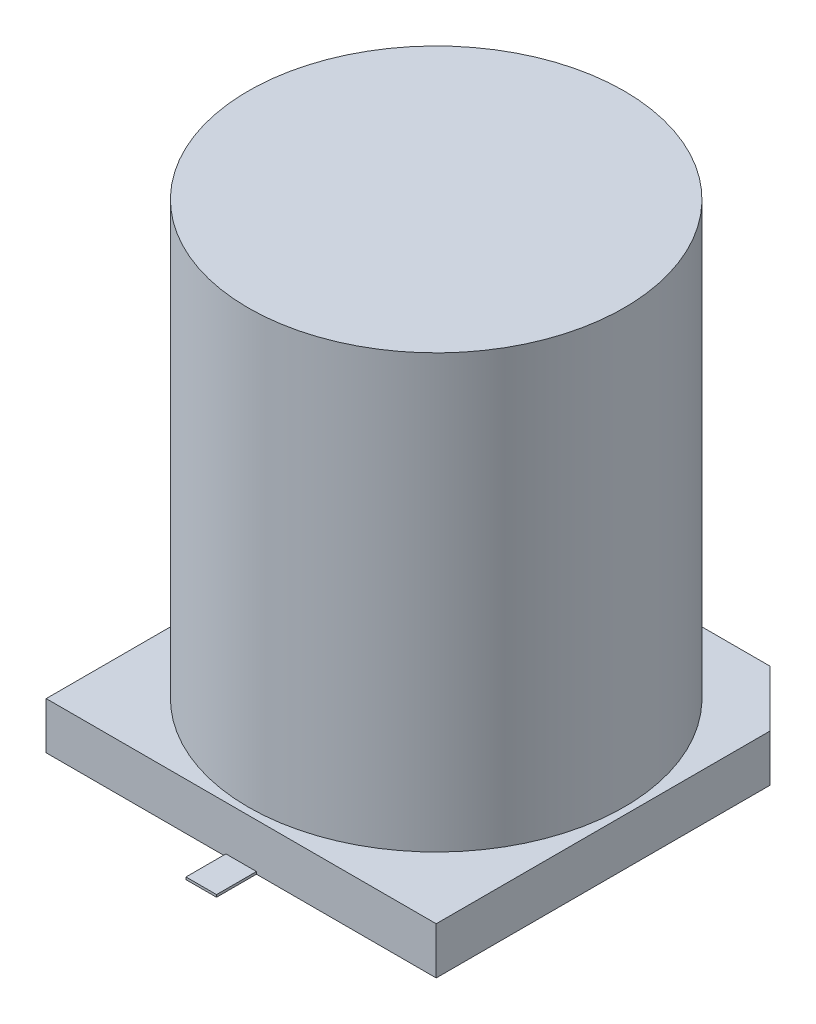
ISO-10303-21;
HEADER;
FILE_DESCRIPTION(('STEP AP214'),'2;1');
FILE_NAME('part.step','',(''),(''),'','','');
FILE_SCHEMA(('AUTOMOTIVE_DESIGN { 1 0 10303 214 1 1 1 1 }'));
ENDSEC;
DATA;
#1=APPLICATION_CONTEXT('core data for automotive mechanical design processes');
#2=APPLICATION_PROTOCOL_DEFINITION('international standard','automotive_design',2000,#1);
#3=PRODUCT_CONTEXT('',#1,'mechanical');
#4=PRODUCT('Part','Part','',(#3));
#5=PRODUCT_RELATED_PRODUCT_CATEGORY('part','',(#4));
#6=PRODUCT_DEFINITION_FORMATION('','',#4);
#7=PRODUCT_DEFINITION_CONTEXT('part definition',#1,'design');
#8=PRODUCT_DEFINITION('design','',#6,#7);
#9=PRODUCT_DEFINITION_SHAPE('','',#8);
#10=(LENGTH_UNIT() NAMED_UNIT(*) SI_UNIT(.MILLI.,.METRE.));
#11=(NAMED_UNIT(*) PLANE_ANGLE_UNIT() SI_UNIT($,.RADIAN.));
#12=(NAMED_UNIT(*) SI_UNIT($,.STERADIAN.) SOLID_ANGLE_UNIT());
#13=UNCERTAINTY_MEASURE_WITH_UNIT(LENGTH_MEASURE(1.E-05),#10,'distance_accuracy_value','');
#14=(GEOMETRIC_REPRESENTATION_CONTEXT(3) GLOBAL_UNCERTAINTY_ASSIGNED_CONTEXT((#13)) GLOBAL_UNIT_ASSIGNED_CONTEXT((#10,
#11,#12)) REPRESENTATION_CONTEXT('',''));
#15=CARTESIAN_POINT('',(0.,0.,0.));
#16=DIRECTION('',(0.,0.,1.));
#17=DIRECTION('',(1.,0.,0.));
#18=AXIS2_PLACEMENT_3D('',#15,#16,#17);
#19=CARTESIAN_POINT('',(0.325000000000075,0.0500000000000014,5.));
#20=DIRECTION('',(0.,0.,-1.));
#21=DIRECTION('',(-1.,0.,0.));
#22=AXIS2_PLACEMENT_3D('',#19,#20,#21);
#23=PLANE('',#22);
#24=DIRECTION('',(0.,1.,0.));
#25=VECTOR('',#24,1.);
#26=CARTESIAN_POINT('',(0.325000000000007,0.0500000000000014,5.));
#27=LINE('',#26,#25);
#28=CARTESIAN_POINT('',(0.325000000000058,0.,5.));
#29=VERTEX_POINT('',#28);
#30=CARTESIAN_POINT('',(0.325000000000041,0.0500000000000014,5.));
#31=VERTEX_POINT('',#30);
#32=EDGE_CURVE('E114',#29,#31,#27,.T.);
#33=ORIENTED_EDGE('',*,*,#32,.T.);
#34=DIRECTION('',(1.,0.,0.));
#35=VECTOR('',#34,1.);
#36=CARTESIAN_POINT('',(0.325000000000075,0.0500000000000014,5.));
#37=LINE('',#36,#35);
#38=CARTESIAN_POINT('',(-0.324999999999923,0.0500000000000014,5.));
#39=VERTEX_POINT('',#38);
#40=EDGE_CURVE('E116',#31,#39,#37,.F.);
#41=ORIENTED_EDGE('',*,*,#40,.T.);
#42=DIRECTION('',(0.,1.,0.));
#43=VECTOR('',#42,1.);
#44=CARTESIAN_POINT('',(-0.324999999999923,0.0500000000000014,4.99999999999999));
#45=LINE('',#44,#43);
#46=CARTESIAN_POINT('',(-0.32499999999994,0.,4.99999999999999));
#47=VERTEX_POINT('',#46);
#48=EDGE_CURVE('E119',#39,#47,#45,.F.);
#49=ORIENTED_EDGE('',*,*,#48,.T.);
#50=DIRECTION('',(1.,0.,0.));
#51=VECTOR('',#50,1.);
#52=CARTESIAN_POINT('',(4.15000000000008,0.,4.99999999999999));
#53=LINE('',#52,#51);
#54=EDGE_CURVE('E154',#47,#29,#53,.T.);
#55=ORIENTED_EDGE('',*,*,#54,.T.);
#56=EDGE_LOOP('',(#33,#41,#49,#55));
#57=FACE_BOUND('',#56,.T.);
#58=ADVANCED_FACE('F17',(#57),#23,.F.);
#59=CARTESIAN_POINT('',(0.325000000000006,0.0500000000000014,-4.99999999999999));
#60=DIRECTION('',(0.,0.,1.));
#61=DIRECTION('',(1.,0.,0.));
#62=AXIS2_PLACEMENT_3D('',#59,#60,#61);
#63=PLANE('',#62);
#64=DIRECTION('',(0.,1.,0.));
#65=VECTOR('',#64,1.);
#66=CARTESIAN_POINT('',(-0.324999999999992,0.0500000000000014,-5.));
#67=LINE('',#66,#65);
#68=CARTESIAN_POINT('',(-0.324999999999992,0.,-4.99999999999999));
#69=VERTEX_POINT('',#68);
#70=CARTESIAN_POINT('',(-0.324999999999992,0.0500000000000014,-4.99999999999999));
#71=VERTEX_POINT('',#70);
#72=EDGE_CURVE('E149',#69,#71,#67,.T.);
#73=ORIENTED_EDGE('',*,*,#72,.T.);
#74=DIRECTION('',(1.,0.,0.));
#75=VECTOR('',#74,1.);
#76=CARTESIAN_POINT('',(-0.324999999999992,0.0500000000000014,-4.99999999999999));
#77=LINE('',#76,#75);
#78=CARTESIAN_POINT('',(0.325000000000019,0.0500000000000014,-4.99999999999999));
#79=VERTEX_POINT('',#78);
#80=EDGE_CURVE('E141',#79,#71,#77,.F.);
#81=ORIENTED_EDGE('',*,*,#80,.F.);
#82=DIRECTION('',(0.,1.,0.));
#83=VECTOR('',#82,1.);
#84=CARTESIAN_POINT('',(0.324999999999991,0.0500000000000014,-4.99999999999999));
#85=LINE('',#84,#83);
#86=CARTESIAN_POINT('',(0.325000000000016,0.,-4.99999999999999));
#87=VERTEX_POINT('',#86);
#88=EDGE_CURVE('E144',#79,#87,#85,.F.);
#89=ORIENTED_EDGE('',*,*,#88,.T.);
#90=DIRECTION('',(1.,0.,0.));
#91=VECTOR('',#90,1.);
#92=CARTESIAN_POINT('',(4.15000000000008,0.,-4.99999999999999));
#93=LINE('',#92,#91);
#94=EDGE_CURVE('E161',#87,#69,#93,.F.);
#95=ORIENTED_EDGE('',*,*,#94,.T.);
#96=EDGE_LOOP('',(#73,#81,#89,#95));
#97=FACE_BOUND('',#96,.T.);
#98=ADVANCED_FACE('F294',(#97),#63,.F.);
#99=CARTESIAN_POINT('',(0.325000000000075,0.0500000000000014,5.));
#100=DIRECTION('',(0.,-1.,0.));
#101=DIRECTION('',(0.,0.,-1.));
#102=AXIS2_PLACEMENT_3D('',#99,#100,#101);
#103=PLANE('',#102);
#104=DIRECTION('',(-1.,0.,0.));
#105=VECTOR('',#104,1.);
#106=CARTESIAN_POINT('',(4.15,0.0500000000000014,4.15000000000008));
#107=LINE('',#106,#105);
#108=CARTESIAN_POINT('',(0.325000000000006,0.0500000000000014,4.15000000000002));
#109=VERTEX_POINT('',#108);
#110=CARTESIAN_POINT('',(-0.32499999999994,0.0500000000000014,4.15000000000002));
#111=VERTEX_POINT('',#110);
#112=EDGE_CURVE('E128',#109,#111,#107,.T.);
#113=ORIENTED_EDGE('',*,*,#112,.T.);
#114=DIRECTION('',(0.,0.,-1.));
#115=VECTOR('',#114,1.);
#116=CARTESIAN_POINT('',(-0.324999999999923,0.0500000000000014,4.99999999999999));
#117=LINE('',#116,#115);
#118=EDGE_CURVE('E125',#111,#39,#117,.F.);
#119=ORIENTED_EDGE('',*,*,#118,.T.);
#120=ORIENTED_EDGE('',*,*,#40,.F.);
#121=DIRECTION('',(0.,0.,1.));
#122=VECTOR('',#121,1.);
#123=CARTESIAN_POINT('',(0.325000000000006,0.0500000000000014,2.05000000000001));
#124=LINE('',#123,#122);
#125=EDGE_CURVE('E139',#31,#109,#124,.F.);
#126=ORIENTED_EDGE('',*,*,#125,.T.);
#127=EDGE_LOOP('',(#113,#119,#120,#126));
#128=FACE_BOUND('',#127,.T.);
#129=ADVANCED_FACE('F126',(#128),#103,.F.);
#130=CARTESIAN_POINT('',(-0.324999999999923,0.0500000000000014,4.99999999999999));
#131=DIRECTION('',(1.,0.,0.));
#132=DIRECTION('',(0.,0.,-1.));
#133=AXIS2_PLACEMENT_3D('',#130,#131,#132);
#134=PLANE('',#133);
#135=DIRECTION('',(0.,1.,0.));
#136=VECTOR('',#135,1.);
#137=CARTESIAN_POINT('',(-0.324999999999992,12.7379725676967,4.15000000000008));
#138=LINE('',#137,#136);
#139=CARTESIAN_POINT('',(-0.324999999999957,0.,4.15000000000002));
#140=VERTEX_POINT('',#139);
#141=EDGE_CURVE('E166',#111,#140,#138,.F.);
#142=ORIENTED_EDGE('',*,*,#141,.T.);
#143=DIRECTION('',(0.,0.,1.));
#144=VECTOR('',#143,1.);
#145=CARTESIAN_POINT('',(-0.324999999999992,0.,-4.14999999999992));
#146=LINE('',#145,#144);
#147=EDGE_CURVE('E134',#140,#47,#146,.T.);
#148=ORIENTED_EDGE('',*,*,#147,.T.);
#149=ORIENTED_EDGE('',*,*,#48,.F.);
#150=ORIENTED_EDGE('',*,*,#118,.F.);
#151=EDGE_LOOP('',(#142,#148,#149,#150));
#152=FACE_BOUND('',#151,.T.);
#153=ADVANCED_FACE('F132',(#152),#134,.F.);
#154=CARTESIAN_POINT('',(0.325000000000006,0.0500000000000014,2.05000000000001));
#155=DIRECTION('',(-1.,0.,0.));
#156=DIRECTION('',(0.,0.,1.));
#157=AXIS2_PLACEMENT_3D('',#154,#155,#156);
#158=PLANE('',#157);
#159=DIRECTION('',(0.,1.,0.));
#160=VECTOR('',#159,1.);
#161=CARTESIAN_POINT('',(0.325000000000006,12.7379725676967,4.15000000000008));
#162=LINE('',#161,#160);
#163=CARTESIAN_POINT('',(0.325000000000041,0.,4.15000000000002));
#164=VERTEX_POINT('',#163);
#165=EDGE_CURVE('E173',#164,#109,#162,.T.);
#166=ORIENTED_EDGE('',*,*,#165,.T.);
#167=ORIENTED_EDGE('',*,*,#125,.F.);
#168=ORIENTED_EDGE('',*,*,#32,.F.);
#169=DIRECTION('',(0.,0.,1.));
#170=VECTOR('',#169,1.);
#171=CARTESIAN_POINT('',(0.325000000000075,0.,-4.14999999999992));
#172=LINE('',#171,#170);
#173=EDGE_CURVE('E156',#29,#164,#172,.F.);
#174=ORIENTED_EDGE('',*,*,#173,.T.);
#175=EDGE_LOOP('',(#166,#167,#168,#174));
#176=FACE_BOUND('',#175,.T.);
#177=ADVANCED_FACE('F304',(#176),#158,.F.);
#178=CARTESIAN_POINT('',(-0.324999999999992,0.0500000000000014,-5.));
#179=DIRECTION('',(0.,1.,0.));
#180=DIRECTION('',(0.,0.,1.));
#181=AXIS2_PLACEMENT_3D('',#178,#179,#180);
#182=PLANE('',#181);
#183=ORIENTED_EDGE('',*,*,#80,.T.);
#184=DIRECTION('',(0.,0.,-1.));
#185=VECTOR('',#184,1.);
#186=CARTESIAN_POINT('',(-0.324999999999992,0.0500000000000014,-5.));
#187=LINE('',#186,#185);
#188=CARTESIAN_POINT('',(-0.324999999999975,0.0500000000000014,-4.14999999999998));
#189=VERTEX_POINT('',#188);
#190=EDGE_CURVE('E151',#71,#189,#187,.F.);
#191=ORIENTED_EDGE('',*,*,#190,.T.);
#192=DIRECTION('',(1.,0.,0.));
#193=VECTOR('',#192,1.);
#194=CARTESIAN_POINT('',(2.95000000000008,0.0500000000000014,-4.14999999999992));
#195=LINE('',#194,#193);
#196=CARTESIAN_POINT('',(0.325000000000054,0.0500000000000014,-4.14999999999998));
#197=VERTEX_POINT('',#196);
#198=EDGE_CURVE('E184',#189,#197,#195,.T.);
#199=ORIENTED_EDGE('',*,*,#198,.T.);
#200=DIRECTION('',(0.,0.,1.));
#201=VECTOR('',#200,1.);
#202=CARTESIAN_POINT('',(0.324999999999992,0.0500000000000014,-2.05));
#203=LINE('',#202,#201);
#204=EDGE_CURVE('E146',#197,#79,#203,.F.);
#205=ORIENTED_EDGE('',*,*,#204,.T.);
#206=EDGE_LOOP('',(#183,#191,#199,#205));
#207=FACE_BOUND('',#206,.T.);
#208=ADVANCED_FACE('F288',(#207),#182,.T.);
#209=CARTESIAN_POINT('',(0.324999999999992,0.0500000000000014,-2.05));
#210=DIRECTION('',(-1.,0.,0.));
#211=DIRECTION('',(0.,0.,1.));
#212=AXIS2_PLACEMENT_3D('',#209,#210,#211);
#213=PLANE('',#212);
#214=DIRECTION('',(0.,1.,0.));
#215=VECTOR('',#214,1.);
#216=CARTESIAN_POINT('',(0.325000000000075,12.7379725676967,-4.14999999999992));
#217=LINE('',#216,#215);
#218=CARTESIAN_POINT('',(0.325000000000033,0.,-4.14999999999996));
#219=VERTEX_POINT('',#218);
#220=EDGE_CURVE('E186',#197,#219,#217,.F.);
#221=ORIENTED_EDGE('',*,*,#220,.T.);
#222=DIRECTION('',(0.,0.,1.));
#223=VECTOR('',#222,1.);
#224=CARTESIAN_POINT('',(0.325000000000075,0.,-4.14999999999992));
#225=LINE('',#224,#223);
#226=EDGE_CURVE('E158',#219,#87,#225,.F.);
#227=ORIENTED_EDGE('',*,*,#226,.T.);
#228=ORIENTED_EDGE('',*,*,#88,.F.);
#229=ORIENTED_EDGE('',*,*,#204,.F.);
#230=EDGE_LOOP('',(#221,#227,#228,#229));
#231=FACE_BOUND('',#230,.T.);
#232=ADVANCED_FACE('F285',(#231),#213,.F.);
#233=CARTESIAN_POINT('',(-0.324999999999992,0.0500000000000014,-5.));
#234=DIRECTION('',(1.,0.,0.));
#235=DIRECTION('',(0.,0.,-1.));
#236=AXIS2_PLACEMENT_3D('',#233,#234,#235);
#237=PLANE('',#236);
#238=DIRECTION('',(0.,1.,0.));
#239=VECTOR('',#238,1.);
#240=CARTESIAN_POINT('',(-0.324999999999923,12.7379725676967,-4.14999999999992));
#241=LINE('',#240,#239);
#242=CARTESIAN_POINT('',(-0.324999999999975,0.,-4.14999999999998));
#243=VERTEX_POINT('',#242);
#244=EDGE_CURVE('E195',#243,#189,#241,.T.);
#245=ORIENTED_EDGE('',*,*,#244,.T.);
#246=ORIENTED_EDGE('',*,*,#190,.F.);
#247=ORIENTED_EDGE('',*,*,#72,.F.);
#248=DIRECTION('',(0.,0.,1.));
#249=VECTOR('',#248,1.);
#250=CARTESIAN_POINT('',(-0.324999999999992,0.,-4.14999999999992));
#251=LINE('',#250,#249);
#252=EDGE_CURVE('E163',#69,#243,#251,.T.);
#253=ORIENTED_EDGE('',*,*,#252,.T.);
#254=EDGE_LOOP('',(#245,#246,#247,#253));
#255=FACE_BOUND('',#254,.T.);
#256=ADVANCED_FACE('F292',(#255),#237,.F.);
#257=CARTESIAN_POINT('',(4.15000000000008,0.,-4.14999999999992));
#258=DIRECTION('',(0.,1.,0.));
#259=DIRECTION('',(0.,0.,1.));
#260=AXIS2_PLACEMENT_3D('',#257,#258,#259);
#261=PLANE('',#260);
#262=ORIENTED_EDGE('',*,*,#252,.F.);
#263=ORIENTED_EDGE('',*,*,#94,.F.);
#264=ORIENTED_EDGE('',*,*,#226,.F.);
#265=DIRECTION('',(1.,0.,0.));
#266=VECTOR('',#265,1.);
#267=CARTESIAN_POINT('',(2.95000000000008,0.,-4.14999999999992));
#268=LINE('',#267,#266);
#269=CARTESIAN_POINT('',(2.95000000000008,0.,-4.14999999999992));
#270=VERTEX_POINT('',#269);
#271=EDGE_CURVE('E188',#219,#270,#268,.T.);
#272=ORIENTED_EDGE('',*,*,#271,.T.);
#273=DIRECTION('',(0.707106781186546,0.,0.707106781186549));
#274=VECTOR('',#273,1.);
#275=CARTESIAN_POINT('',(2.95000000000008,0.,-4.14999999999992));
#276=LINE('',#275,#274);
#277=CARTESIAN_POINT('',(4.15000000000002,0.,-2.94999999999996));
#278=VERTEX_POINT('',#277);
#279=EDGE_CURVE('E180',#270,#278,#276,.T.);
#280=ORIENTED_EDGE('',*,*,#279,.T.);
#281=DIRECTION('',(0.,0.,1.));
#282=VECTOR('',#281,1.);
#283=CARTESIAN_POINT('',(4.15,0.,4.15000000000008));
#284=LINE('',#283,#282);
#285=CARTESIAN_POINT('',(4.15,0.,4.15000000000004));
#286=VERTEX_POINT('',#285);
#287=EDGE_CURVE('E176',#278,#286,#284,.T.);
#288=ORIENTED_EDGE('',*,*,#287,.T.);
#289=DIRECTION('',(-1.,0.,0.));
#290=VECTOR('',#289,1.);
#291=CARTESIAN_POINT('',(4.15,0.,4.15000000000008));
#292=LINE('',#291,#290);
#293=EDGE_CURVE('E170',#286,#164,#292,.T.);
#294=ORIENTED_EDGE('',*,*,#293,.T.);
#295=ORIENTED_EDGE('',*,*,#173,.F.);
#296=ORIENTED_EDGE('',*,*,#54,.F.);
#297=ORIENTED_EDGE('',*,*,#147,.F.);
#298=DIRECTION('',(-1.,0.,0.));
#299=VECTOR('',#298,1.);
#300=CARTESIAN_POINT('',(4.15,0.,4.15000000000008));
#301=LINE('',#300,#299);
#302=CARTESIAN_POINT('',(-4.14999999999998,0.,4.15000000000004));
#303=VERTEX_POINT('',#302);
#304=EDGE_CURVE('E168',#140,#303,#301,.T.);
#305=ORIENTED_EDGE('',*,*,#304,.T.);
#306=DIRECTION('',(0.,0.,-1.));
#307=VECTOR('',#306,1.);
#308=CARTESIAN_POINT('',(-4.15,0.,4.15));
#309=LINE('',#308,#307);
#310=CARTESIAN_POINT('',(-4.14999999999994,0.,-2.94999999999999));
#311=VERTEX_POINT('',#310);
#312=EDGE_CURVE('E205',#303,#311,#309,.T.);
#313=ORIENTED_EDGE('',*,*,#312,.T.);
#314=DIRECTION('',(0.707106781186549,0.,-0.707106781186546));
#315=VECTOR('',#314,1.);
#316=CARTESIAN_POINT('',(-4.14999999999992,0.,-2.94999999999999));
#317=LINE('',#316,#315);
#318=CARTESIAN_POINT('',(-2.94999999999991,0.,-4.14999999999998));
#319=VERTEX_POINT('',#318);
#320=EDGE_CURVE('E198',#311,#319,#317,.T.);
#321=ORIENTED_EDGE('',*,*,#320,.T.);
#322=DIRECTION('',(1.,0.,0.));
#323=VECTOR('',#322,1.);
#324=CARTESIAN_POINT('',(2.95000000000008,0.,-4.14999999999992));
#325=LINE('',#324,#323);
#326=EDGE_CURVE('E192',#319,#243,#325,.T.);
#327=ORIENTED_EDGE('',*,*,#326,.T.);
#328=EDGE_LOOP('',(#262,#263,#264,#272,#280,#288,#294,#295,#296,#297,#305,#313,#321,#327));
#329=FACE_BOUND('',#328,.T.);
#330=ADVANCED_FACE('F262',(#329),#261,.F.);
#331=CARTESIAN_POINT('',(4.15,12.7379725676967,4.15000000000008));
#332=DIRECTION('',(0.,0.,-1.));
#333=DIRECTION('',(-1.,0.,0.));
#334=AXIS2_PLACEMENT_3D('',#331,#332,#333);
#335=PLANE('',#334);
#336=ORIENTED_EDGE('',*,*,#293,.F.);
#337=DIRECTION('',(0.,1.,0.));
#338=VECTOR('',#337,1.);
#339=CARTESIAN_POINT('',(4.15,12.7379725676967,4.15000000000008));
#340=LINE('',#339,#338);
#341=CARTESIAN_POINT('',(4.15,1.,4.15000000000006));
#342=VERTEX_POINT('',#341);
#343=EDGE_CURVE('E178',#286,#342,#340,.T.);
#344=ORIENTED_EDGE('',*,*,#343,.T.);
#345=DIRECTION('',(1.,0.,0.));
#346=VECTOR('',#345,1.);
#347=CARTESIAN_POINT('',(0.,1.,4.15));
#348=LINE('',#347,#346);
#349=CARTESIAN_POINT('',(-4.14999999999998,1.,4.15000000000004));
#350=VERTEX_POINT('',#349);
#351=EDGE_CURVE('E208',#350,#342,#348,.T.);
#352=ORIENTED_EDGE('',*,*,#351,.F.);
#353=DIRECTION('',(0.,1.,0.));
#354=VECTOR('',#353,1.);
#355=CARTESIAN_POINT('',(-4.15,12.7379725676967,4.15));
#356=LINE('',#355,#354);
#357=EDGE_CURVE('E202',#350,#303,#356,.F.);
#358=ORIENTED_EDGE('',*,*,#357,.T.);
#359=ORIENTED_EDGE('',*,*,#304,.F.);
#360=ORIENTED_EDGE('',*,*,#141,.F.);
#361=ORIENTED_EDGE('',*,*,#112,.F.);
#362=ORIENTED_EDGE('',*,*,#165,.F.);
#363=EDGE_LOOP('',(#336,#344,#352,#358,#359,#360,#361,#362));
#364=FACE_BOUND('',#363,.T.);
#365=ADVANCED_FACE('F269',(#364),#335,.F.);
#366=CARTESIAN_POINT('',(4.15,12.7379725676967,4.15000000000008));
#367=DIRECTION('',(-1.,0.,0.));
#368=DIRECTION('',(0.,0.,1.));
#369=AXIS2_PLACEMENT_3D('',#366,#367,#368);
#370=PLANE('',#369);
#371=ORIENTED_EDGE('',*,*,#343,.F.);
#372=ORIENTED_EDGE('',*,*,#287,.F.);
#373=DIRECTION('',(0.,1.,0.));
#374=VECTOR('',#373,1.);
#375=CARTESIAN_POINT('',(4.15000000000007,12.7379725676967,-2.94999999999992));
#376=LINE('',#375,#374);
#377=CARTESIAN_POINT('',(4.15000000000002,1.,-2.94999999999994));
#378=VERTEX_POINT('',#377);
#379=EDGE_CURVE('E182',#278,#378,#376,.T.);
#380=ORIENTED_EDGE('',*,*,#379,.T.);
#381=DIRECTION('',(0.,0.,1.));
#382=VECTOR('',#381,1.);
#383=CARTESIAN_POINT('',(4.15,1.,0.));
#384=LINE('',#383,#382);
#385=EDGE_CURVE('E211',#342,#378,#384,.F.);
#386=ORIENTED_EDGE('',*,*,#385,.F.);
#387=EDGE_LOOP('',(#371,#372,#380,#386));
#388=FACE_BOUND('',#387,.T.);
#389=ADVANCED_FACE('F274',(#388),#370,.F.);
#390=CARTESIAN_POINT('',(2.95000000000008,12.7379725676967,-4.14999999999992));
#391=DIRECTION('',(-0.707106781186549,0.,0.707106781186546));
#392=DIRECTION('',(0.707106781186546,0.,0.707106781186549));
#393=AXIS2_PLACEMENT_3D('',#390,#391,#392);
#394=PLANE('',#393);
#395=ORIENTED_EDGE('',*,*,#379,.F.);
#396=ORIENTED_EDGE('',*,*,#279,.F.);
#397=DIRECTION('',(0.,1.,0.));
#398=VECTOR('',#397,1.);
#399=CARTESIAN_POINT('',(2.95000000000008,12.7379725676967,-4.14999999999992));
#400=LINE('',#399,#398);
#401=CARTESIAN_POINT('',(2.95000000000008,1.,-4.14999999999992));
#402=VERTEX_POINT('',#401);
#403=EDGE_CURVE('E190',#270,#402,#400,.T.);
#404=ORIENTED_EDGE('',*,*,#403,.T.);
#405=DIRECTION('',(-0.707106781186547,0.,-0.707106781186547));
#406=VECTOR('',#405,1.);
#407=CARTESIAN_POINT('',(4.15000000000007,1.,-2.94999999999992));
#408=LINE('',#407,#406);
#409=EDGE_CURVE('E214',#378,#402,#408,.T.);
#410=ORIENTED_EDGE('',*,*,#409,.F.);
#411=EDGE_LOOP('',(#395,#396,#404,#410));
#412=FACE_BOUND('',#411,.T.);
#413=ADVANCED_FACE('F279',(#412),#394,.F.);
#414=CARTESIAN_POINT('',(2.95000000000008,12.7379725676967,-4.14999999999992));
#415=DIRECTION('',(0.,0.,1.));
#416=DIRECTION('',(1.,0.,0.));
#417=AXIS2_PLACEMENT_3D('',#414,#415,#416);
#418=PLANE('',#417);
#419=ORIENTED_EDGE('',*,*,#326,.F.);
#420=DIRECTION('',(0.,1.,0.));
#421=VECTOR('',#420,1.);
#422=CARTESIAN_POINT('',(-2.94999999999992,12.7379725676967,-4.14999999999999));
#423=LINE('',#422,#421);
#424=CARTESIAN_POINT('',(-2.94999999999993,0.999999999999999,-4.14999999999994));
#425=VERTEX_POINT('',#424);
#426=EDGE_CURVE('E200',#319,#425,#423,.T.);
#427=ORIENTED_EDGE('',*,*,#426,.T.);
#428=DIRECTION('',(1.,0.,0.));
#429=VECTOR('',#428,1.);
#430=CARTESIAN_POINT('',(0.,1.,-4.14999999999992));
#431=LINE('',#430,#429);
#432=EDGE_CURVE('E217',#402,#425,#431,.F.);
#433=ORIENTED_EDGE('',*,*,#432,.F.);
#434=ORIENTED_EDGE('',*,*,#403,.F.);
#435=ORIENTED_EDGE('',*,*,#271,.F.);
#436=ORIENTED_EDGE('',*,*,#220,.F.);
#437=ORIENTED_EDGE('',*,*,#198,.F.);
#438=ORIENTED_EDGE('',*,*,#244,.F.);
#439=EDGE_LOOP('',(#419,#427,#433,#434,#435,#436,#437,#438));
#440=FACE_BOUND('',#439,.T.);
#441=ADVANCED_FACE('F256',(#440),#418,.F.);
#442=CARTESIAN_POINT('',(-4.14999999999992,12.7379725676967,-2.94999999999999));
#443=DIRECTION('',(0.707106781186546,0.,0.707106781186549));
#444=DIRECTION('',(0.707106781186549,0.,-0.707106781186546));
#445=AXIS2_PLACEMENT_3D('',#442,#443,#444);
#446=PLANE('',#445);
#447=ORIENTED_EDGE('',*,*,#426,.F.);
#448=ORIENTED_EDGE('',*,*,#320,.F.);
#449=DIRECTION('',(0.,1.,0.));
#450=VECTOR('',#449,1.);
#451=CARTESIAN_POINT('',(-4.15,12.7379725676967,-2.94999999999999));
#452=LINE('',#451,#450);
#453=CARTESIAN_POINT('',(-4.14999999999994,0.999999999999997,-2.94999999999999));
#454=VERTEX_POINT('',#453);
#455=EDGE_CURVE('E33',#311,#454,#452,.T.);
#456=ORIENTED_EDGE('',*,*,#455,.T.);
#457=DIRECTION('',(-0.707106781186552,0.,0.707106781186543));
#458=VECTOR('',#457,1.);
#459=CARTESIAN_POINT('',(-2.94999999999991,1.,-4.14999999999999));
#460=LINE('',#459,#458);
#461=EDGE_CURVE('E220',#425,#454,#460,.T.);
#462=ORIENTED_EDGE('',*,*,#461,.F.);
#463=EDGE_LOOP('',(#447,#448,#456,#462));
#464=FACE_BOUND('',#463,.T.);
#465=ADVANCED_FACE('F243',(#464),#446,.F.);
#466=CARTESIAN_POINT('',(-4.15,12.7379725676967,4.15));
#467=DIRECTION('',(1.,0.,0.));
#468=DIRECTION('',(0.,0.,-1.));
#469=AXIS2_PLACEMENT_3D('',#466,#467,#468);
#470=PLANE('',#469);
#471=ORIENTED_EDGE('',*,*,#455,.F.);
#472=ORIENTED_EDGE('',*,*,#312,.F.);
#473=ORIENTED_EDGE('',*,*,#357,.F.);
#474=DIRECTION('',(0.,0.,1.));
#475=VECTOR('',#474,1.);
#476=CARTESIAN_POINT('',(-4.14999999999992,1.,0.));
#477=LINE('',#476,#475);
#478=EDGE_CURVE('E223',#454,#350,#477,.T.);
#479=ORIENTED_EDGE('',*,*,#478,.F.);
#480=EDGE_LOOP('',(#471,#472,#473,#479));
#481=FACE_BOUND('',#480,.T.);
#482=ADVANCED_FACE('F234',(#481),#470,.F.);
#483=CARTESIAN_POINT('',(0.,10.2,0.));
#484=DIRECTION('',(0.,1.,0.));
#485=DIRECTION('',(0.,0.,1.));
#486=AXIS2_PLACEMENT_3D('',#483,#484,#485);
#487=PLANE('',#486);
#488=CARTESIAN_POINT('',(0.,10.2,0.));
#489=DIRECTION('',(0.,-1.,0.));
#490=DIRECTION('',(0.,0.,-1.));
#491=AXIS2_PLACEMENT_3D('',#488,#489,#490);
#492=CIRCLE('',#491,3.99999999999999);
#493=CARTESIAN_POINT('',(0.,10.2,-3.99999999999999));
#494=VERTEX_POINT('',#493);
#495=EDGE_CURVE('E20',#494,#494,#492,.T.);
#496=ORIENTED_EDGE('',*,*,#495,.F.);
#497=EDGE_LOOP('',(#496));
#498=FACE_BOUND('',#497,.T.);
#499=ADVANCED_FACE('F231',(#498),#487,.T.);
#500=CARTESIAN_POINT('',(0.,1.,0.));
#501=DIRECTION('',(0.,1.,0.));
#502=DIRECTION('',(0.,0.,1.));
#503=AXIS2_PLACEMENT_3D('',#500,#501,#502);
#504=PLANE('',#503);
#505=CARTESIAN_POINT('',(0.,1.,0.));
#506=DIRECTION('',(0.,-1.,0.));
#507=DIRECTION('',(0.,0.,-1.));
#508=AXIS2_PLACEMENT_3D('',#505,#506,#507);
#509=CIRCLE('',#508,3.99999999999999);
#510=CARTESIAN_POINT('',(0.,1.,-3.99999999999999));
#511=VERTEX_POINT('',#510);
#512=EDGE_CURVE('E11',#511,#511,#509,.F.);
#513=ORIENTED_EDGE('',*,*,#512,.F.);
#514=EDGE_LOOP('',(#513));
#515=FACE_BOUND('',#514,.T.);
#516=ORIENTED_EDGE('',*,*,#461,.T.);
#517=ORIENTED_EDGE('',*,*,#478,.T.);
#518=ORIENTED_EDGE('',*,*,#351,.T.);
#519=ORIENTED_EDGE('',*,*,#385,.T.);
#520=ORIENTED_EDGE('',*,*,#409,.T.);
#521=ORIENTED_EDGE('',*,*,#432,.T.);
#522=EDGE_LOOP('',(#516,#517,#518,#519,#520,#521));
#523=FACE_BOUND('',#522,.T.);
#524=ADVANCED_FACE('F233',(#515,#523),#504,.T.);
#525=CARTESIAN_POINT('',(0.,10.2,0.));
#526=DIRECTION('',(0.,-1.,0.));
#527=DIRECTION('',(0.,0.,-1.));
#528=AXIS2_PLACEMENT_3D('',#525,#526,#527);
#529=CYLINDRICAL_SURFACE('',#528,3.99999999999999);
#530=ORIENTED_EDGE('',*,*,#512,.T.);
#531=EDGE_LOOP('',(#530));
#532=FACE_BOUND('',#531,.T.);
#533=ORIENTED_EDGE('',*,*,#495,.T.);
#534=EDGE_LOOP('',(#533));
#535=FACE_BOUND('',#534,.T.);
#536=ADVANCED_FACE('F229',(#532,#535),#529,.T.);
#537=CLOSED_SHELL('',(#58,#98,#129,#153,#177,#208,#232,#256,#330,#365,#389,#413,#441,#465,#482,
#499,#524,#536));
#538=MANIFOLD_SOLID_BREP('B1',#537);
#539=ADVANCED_BREP_SHAPE_REPRESENTATION('',(#18,#538),#14);
#540=SHAPE_DEFINITION_REPRESENTATION(#9,#539);
ENDSEC;
END-ISO-10303-21;
